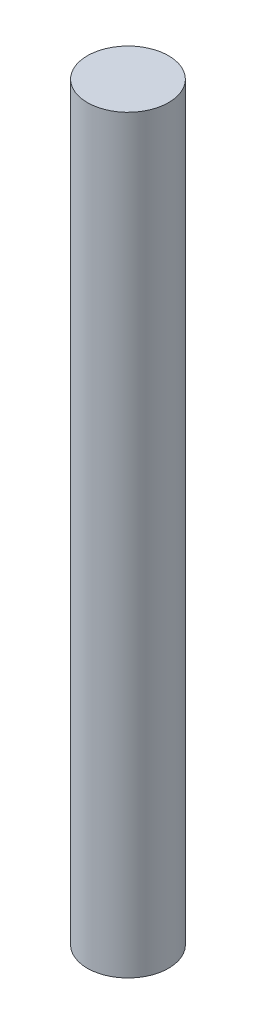
ISO-10303-21;
HEADER;
FILE_DESCRIPTION(('STEP AP214'),'2;1');
FILE_NAME('part.step','',(''),(''),'','','');
FILE_SCHEMA(('AUTOMOTIVE_DESIGN { 1 0 10303 214 1 1 1 1 }'));
ENDSEC;
DATA;
#1=APPLICATION_CONTEXT('core data for automotive mechanical design processes');
#2=APPLICATION_PROTOCOL_DEFINITION('international standard','automotive_design',2000,#1);
#3=PRODUCT_CONTEXT('',#1,'mechanical');
#4=PRODUCT('Part','Part','',(#3));
#5=PRODUCT_RELATED_PRODUCT_CATEGORY('part','',(#4));
#6=PRODUCT_DEFINITION_FORMATION('','',#4);
#7=PRODUCT_DEFINITION_CONTEXT('part definition',#1,'design');
#8=PRODUCT_DEFINITION('design','',#6,#7);
#9=PRODUCT_DEFINITION_SHAPE('','',#8);
#10=(LENGTH_UNIT() NAMED_UNIT(*) SI_UNIT(.MILLI.,.METRE.));
#11=(NAMED_UNIT(*) PLANE_ANGLE_UNIT() SI_UNIT($,.RADIAN.));
#12=(NAMED_UNIT(*) SI_UNIT($,.STERADIAN.) SOLID_ANGLE_UNIT());
#13=UNCERTAINTY_MEASURE_WITH_UNIT(LENGTH_MEASURE(1.E-05),#10,'distance_accuracy_value','');
#14=(GEOMETRIC_REPRESENTATION_CONTEXT(3) GLOBAL_UNCERTAINTY_ASSIGNED_CONTEXT((#13)) GLOBAL_UNIT_ASSIGNED_CONTEXT((#10,
#11,#12)) REPRESENTATION_CONTEXT('',''));
#15=CARTESIAN_POINT('',(0.,0.,0.));
#16=DIRECTION('',(0.,0.,1.));
#17=DIRECTION('',(1.,0.,0.));
#18=AXIS2_PLACEMENT_3D('',#15,#16,#17);
#19=CARTESIAN_POINT('',(0.,36.,0.));
#20=DIRECTION('',(0.,-1.,0.));
#21=DIRECTION('',(0.,0.,-1.));
#22=AXIS2_PLACEMENT_3D('',#19,#20,#21);
#23=CYLINDRICAL_SURFACE('',#22,1.95);
#24=CARTESIAN_POINT('',(0.,36.,0.));
#25=DIRECTION('',(0.,1.,0.));
#26=DIRECTION('',(0.,0.,1.));
#27=AXIS2_PLACEMENT_3D('',#24,#25,#26);
#28=CIRCLE('',#27,1.95);
#29=CARTESIAN_POINT('',(0.,36.,1.95));
#30=VERTEX_POINT('',#29);
#31=EDGE_CURVE('E10',#30,#30,#28,.T.);
#32=ORIENTED_EDGE('',*,*,#31,.F.);
#33=EDGE_LOOP('',(#32));
#34=FACE_BOUND('',#33,.T.);
#35=CARTESIAN_POINT('',(0.,0.,0.));
#36=DIRECTION('',(0.,1.,0.));
#37=DIRECTION('',(0.,0.,1.));
#38=AXIS2_PLACEMENT_3D('',#35,#36,#37);
#39=CIRCLE('',#38,1.95);
#40=CARTESIAN_POINT('',(0.,0.,1.95));
#41=VERTEX_POINT('',#40);
#42=EDGE_CURVE('E40',#41,#41,#39,.T.);
#43=ORIENTED_EDGE('',*,*,#42,.T.);
#44=EDGE_LOOP('',(#43));
#45=FACE_BOUND('',#44,.T.);
#46=ADVANCED_FACE('F37',(#34,#45),#23,.T.);
#47=CARTESIAN_POINT('',(0.,36.,0.));
#48=DIRECTION('',(0.,1.,0.));
#49=DIRECTION('',(0.,0.,1.));
#50=AXIS2_PLACEMENT_3D('',#47,#48,#49);
#51=PLANE('',#50);
#52=ORIENTED_EDGE('',*,*,#31,.T.);
#53=EDGE_LOOP('',(#52));
#54=FACE_BOUND('',#53,.T.);
#55=ADVANCED_FACE('F54',(#54),#51,.T.);
#56=CARTESIAN_POINT('',(0.,0.,0.));
#57=DIRECTION('',(0.,1.,0.));
#58=DIRECTION('',(0.,0.,1.));
#59=AXIS2_PLACEMENT_3D('',#56,#57,#58);
#60=PLANE('',#59);
#61=ORIENTED_EDGE('',*,*,#42,.F.);
#62=EDGE_LOOP('',(#61));
#63=FACE_BOUND('',#62,.T.);
#64=ADVANCED_FACE('F52',(#63),#60,.F.);
#65=CLOSED_SHELL('',(#46,#55,#64));
#66=MANIFOLD_SOLID_BREP('B2',#65);
#67=ADVANCED_BREP_SHAPE_REPRESENTATION('',(#18,#66),#14);
#68=SHAPE_DEFINITION_REPRESENTATION(#9,#67);
ENDSEC;
END-ISO-10303-21;
